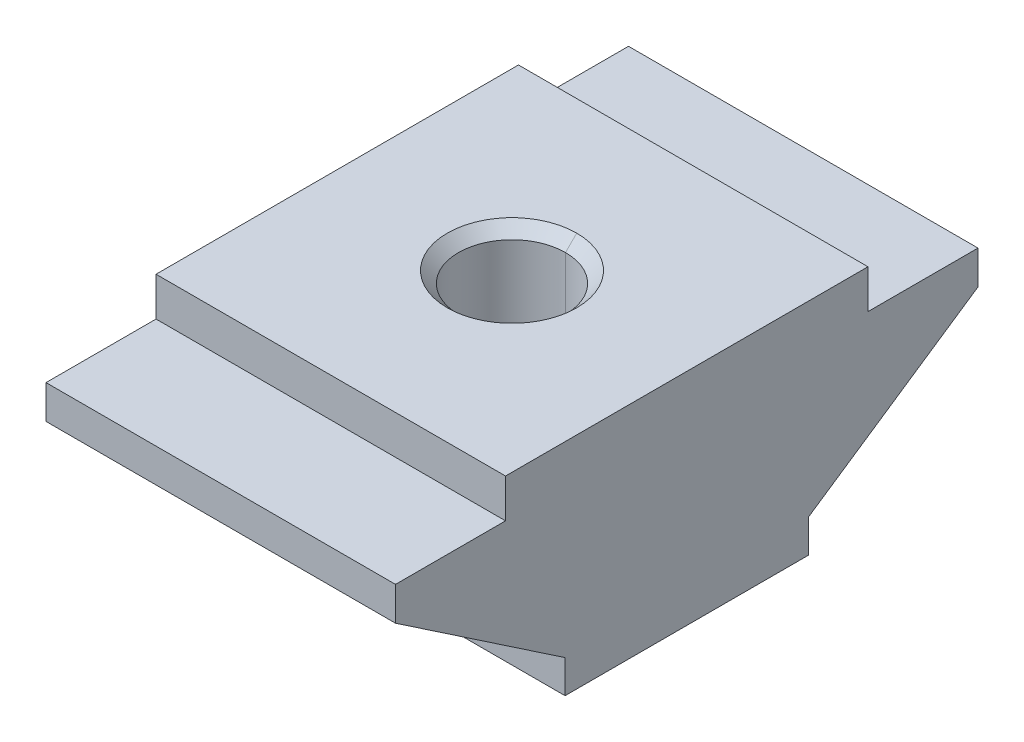
ISO-10303-21;
HEADER;
FILE_DESCRIPTION(('STEP AP214'),'2;1');
FILE_NAME('part.step','',(''),(''),'','','');
FILE_SCHEMA(('AUTOMOTIVE_DESIGN { 1 0 10303 214 1 1 1 1 }'));
ENDSEC;
DATA;
#1=APPLICATION_CONTEXT('core data for automotive mechanical design processes');
#2=APPLICATION_PROTOCOL_DEFINITION('international standard','automotive_design',2000,#1);
#3=PRODUCT_CONTEXT('',#1,'mechanical');
#4=PRODUCT('Part','Part','',(#3));
#5=PRODUCT_RELATED_PRODUCT_CATEGORY('part','',(#4));
#6=PRODUCT_DEFINITION_FORMATION('','',#4);
#7=PRODUCT_DEFINITION_CONTEXT('part definition',#1,'design');
#8=PRODUCT_DEFINITION('design','',#6,#7);
#9=PRODUCT_DEFINITION_SHAPE('','',#8);
#10=(LENGTH_UNIT() NAMED_UNIT(*) SI_UNIT(.MILLI.,.METRE.));
#11=(NAMED_UNIT(*) PLANE_ANGLE_UNIT() SI_UNIT($,.RADIAN.));
#12=(NAMED_UNIT(*) SI_UNIT($,.STERADIAN.) SOLID_ANGLE_UNIT());
#13=UNCERTAINTY_MEASURE_WITH_UNIT(LENGTH_MEASURE(1.E-05),#10,'distance_accuracy_value','');
#14=(GEOMETRIC_REPRESENTATION_CONTEXT(3) GLOBAL_UNCERTAINTY_ASSIGNED_CONTEXT((#13)) GLOBAL_UNIT_ASSIGNED_CONTEXT((#10,
#11,#12)) REPRESENTATION_CONTEXT('',''));
#15=CARTESIAN_POINT('',(0.,0.,0.));
#16=DIRECTION('',(0.,0.,1.));
#17=DIRECTION('',(1.,0.,0.));
#18=AXIS2_PLACEMENT_3D('',#15,#16,#17);
#19=CARTESIAN_POINT('',(6.75,7.,7.));
#20=DIRECTION('',(0.,-1.,0.));
#21=DIRECTION('',(0.,0.,-1.));
#22=AXIS2_PLACEMENT_3D('',#19,#20,#21);
#23=PLANE('',#22);
#24=DIRECTION('',(0.,0.,1.));
#25=VECTOR('',#24,1.);
#26=CARTESIAN_POINT('',(-6.75,7.,7.));
#27=LINE('',#26,#25);
#28=CARTESIAN_POINT('',(-6.75,7.,7.));
#29=VERTEX_POINT('',#28);
#30=CARTESIAN_POINT('',(-6.75,7.,11.25));
#31=VERTEX_POINT('',#30);
#32=EDGE_CURVE('E13',#29,#31,#27,.T.);
#33=ORIENTED_EDGE('',*,*,#32,.T.);
#34=DIRECTION('',(-1.,0.,0.));
#35=VECTOR('',#34,1.);
#36=CARTESIAN_POINT('',(6.75,7.,11.25));
#37=LINE('',#36,#35);
#38=CARTESIAN_POINT('',(6.75,7.,11.25));
#39=VERTEX_POINT('',#38);
#40=EDGE_CURVE('E33',#39,#31,#37,.T.);
#41=ORIENTED_EDGE('',*,*,#40,.F.);
#42=DIRECTION('',(0.,0.,1.));
#43=VECTOR('',#42,1.);
#44=CARTESIAN_POINT('',(6.75,7.,7.));
#45=LINE('',#44,#43);
#46=CARTESIAN_POINT('',(6.75,7.,7.));
#47=VERTEX_POINT('',#46);
#48=EDGE_CURVE('E365',#47,#39,#45,.T.);
#49=ORIENTED_EDGE('',*,*,#48,.F.);
#50=DIRECTION('',(-1.,0.,0.));
#51=VECTOR('',#50,1.);
#52=CARTESIAN_POINT('',(6.75,7.,7.));
#53=LINE('',#52,#51);
#54=EDGE_CURVE('E361',#47,#29,#53,.T.);
#55=ORIENTED_EDGE('',*,*,#54,.T.);
#56=EDGE_LOOP('',(#33,#41,#49,#55));
#57=FACE_BOUND('',#56,.T.);
#58=ADVANCED_FACE('F25',(#57),#23,.F.);
#59=CARTESIAN_POINT('',(6.75,8.5,7.));
#60=DIRECTION('',(0.,0.,-1.));
#61=DIRECTION('',(-1.,0.,0.));
#62=AXIS2_PLACEMENT_3D('',#59,#60,#61);
#63=PLANE('',#62);
#64=DIRECTION('',(0.,-1.,0.));
#65=VECTOR('',#64,1.);
#66=CARTESIAN_POINT('',(-6.75,8.5,7.));
#67=LINE('',#66,#65);
#68=CARTESIAN_POINT('',(-6.75,8.5,7.));
#69=VERTEX_POINT('',#68);
#70=EDGE_CURVE('E356',#69,#29,#67,.T.);
#71=ORIENTED_EDGE('',*,*,#70,.T.);
#72=ORIENTED_EDGE('',*,*,#54,.F.);
#73=DIRECTION('',(0.,-1.,0.));
#74=VECTOR('',#73,1.);
#75=CARTESIAN_POINT('',(6.75,8.5,7.));
#76=LINE('',#75,#74);
#77=CARTESIAN_POINT('',(6.75,8.5,7.));
#78=VERTEX_POINT('',#77);
#79=EDGE_CURVE('E351',#78,#47,#76,.T.);
#80=ORIENTED_EDGE('',*,*,#79,.F.);
#81=DIRECTION('',(-1.,0.,0.));
#82=VECTOR('',#81,1.);
#83=CARTESIAN_POINT('',(6.75,8.5,7.));
#84=LINE('',#83,#82);
#85=EDGE_CURVE('E347',#78,#69,#84,.T.);
#86=ORIENTED_EDGE('',*,*,#85,.T.);
#87=EDGE_LOOP('',(#71,#72,#80,#86));
#88=FACE_BOUND('',#87,.T.);
#89=ADVANCED_FACE('F391',(#88),#63,.F.);
#90=CARTESIAN_POINT('',(6.75,8.5,-7.));
#91=DIRECTION('',(0.,-1.,0.));
#92=DIRECTION('',(0.,0.,-1.));
#93=AXIS2_PLACEMENT_3D('',#90,#91,#92);
#94=PLANE('',#93);
#95=CARTESIAN_POINT('',(0.,8.5,0.));
#96=DIRECTION('',(0.,-1.,0.));
#97=DIRECTION('',(0.,0.,-1.));
#98=AXIS2_PLACEMENT_3D('',#95,#96,#97);
#99=CIRCLE('',#98,2.5);
#100=CARTESIAN_POINT('',(0.,8.5,-2.5));
#101=VERTEX_POINT('',#100);
#102=CARTESIAN_POINT('',(0.,8.5,2.5));
#103=VERTEX_POINT('',#102);
#104=EDGE_CURVE('E162',#101,#103,#99,.T.);
#105=ORIENTED_EDGE('',*,*,#104,.T.);
#106=CARTESIAN_POINT('',(0.,8.5,0.));
#107=DIRECTION('',(0.,-1.,0.));
#108=DIRECTION('',(0.,0.,-1.));
#109=AXIS2_PLACEMENT_3D('',#106,#107,#108);
#110=CIRCLE('',#109,2.5);
#111=EDGE_CURVE('E340',#103,#101,#110,.T.);
#112=ORIENTED_EDGE('',*,*,#111,.T.);
#113=EDGE_LOOP('',(#105,#112));
#114=FACE_BOUND('',#113,.T.);
#115=DIRECTION('',(0.,0.,1.));
#116=VECTOR('',#115,1.);
#117=CARTESIAN_POINT('',(-6.75,8.5,-7.));
#118=LINE('',#117,#116);
#119=CARTESIAN_POINT('',(-6.75,8.5,-7.));
#120=VERTEX_POINT('',#119);
#121=EDGE_CURVE('E335',#120,#69,#118,.T.);
#122=ORIENTED_EDGE('',*,*,#121,.T.);
#123=ORIENTED_EDGE('',*,*,#85,.F.);
#124=DIRECTION('',(0.,0.,1.));
#125=VECTOR('',#124,1.);
#126=CARTESIAN_POINT('',(6.75,8.5,-7.));
#127=LINE('',#126,#125);
#128=CARTESIAN_POINT('',(6.75,8.5,-7.));
#129=VERTEX_POINT('',#128);
#130=EDGE_CURVE('E330',#129,#78,#127,.T.);
#131=ORIENTED_EDGE('',*,*,#130,.F.);
#132=DIRECTION('',(-1.,0.,0.));
#133=VECTOR('',#132,1.);
#134=CARTESIAN_POINT('',(6.75,8.5,-7.));
#135=LINE('',#134,#133);
#136=EDGE_CURVE('E326',#129,#120,#135,.T.);
#137=ORIENTED_EDGE('',*,*,#136,.T.);
#138=EDGE_LOOP('',(#122,#123,#131,#137));
#139=FACE_BOUND('',#138,.T.);
#140=ADVANCED_FACE('F397',(#114,#139),#94,.F.);
#141=CARTESIAN_POINT('',(6.75,7.,-7.));
#142=DIRECTION('',(0.,0.,1.));
#143=DIRECTION('',(1.,0.,0.));
#144=AXIS2_PLACEMENT_3D('',#141,#142,#143);
#145=PLANE('',#144);
#146=DIRECTION('',(0.,1.,0.));
#147=VECTOR('',#146,1.);
#148=CARTESIAN_POINT('',(-6.75,7.,-7.));
#149=LINE('',#148,#147);
#150=CARTESIAN_POINT('',(-6.75,7.,-7.));
#151=VERTEX_POINT('',#150);
#152=EDGE_CURVE('E321',#151,#120,#149,.T.);
#153=ORIENTED_EDGE('',*,*,#152,.T.);
#154=ORIENTED_EDGE('',*,*,#136,.F.);
#155=DIRECTION('',(0.,1.,0.));
#156=VECTOR('',#155,1.);
#157=CARTESIAN_POINT('',(6.75,7.,-7.));
#158=LINE('',#157,#156);
#159=CARTESIAN_POINT('',(6.75,7.,-7.));
#160=VERTEX_POINT('',#159);
#161=EDGE_CURVE('E316',#160,#129,#158,.T.);
#162=ORIENTED_EDGE('',*,*,#161,.F.);
#163=DIRECTION('',(-1.,0.,0.));
#164=VECTOR('',#163,1.);
#165=CARTESIAN_POINT('',(6.75,7.,-7.));
#166=LINE('',#165,#164);
#167=EDGE_CURVE('E312',#160,#151,#166,.T.);
#168=ORIENTED_EDGE('',*,*,#167,.T.);
#169=EDGE_LOOP('',(#153,#154,#162,#168));
#170=FACE_BOUND('',#169,.T.);
#171=ADVANCED_FACE('F400',(#170),#145,.F.);
#172=CARTESIAN_POINT('',(6.75,7.,-11.25));
#173=DIRECTION('',(0.,-1.,0.));
#174=DIRECTION('',(0.,0.,-1.));
#175=AXIS2_PLACEMENT_3D('',#172,#173,#174);
#176=PLANE('',#175);
#177=DIRECTION('',(0.,0.,1.));
#178=VECTOR('',#177,1.);
#179=CARTESIAN_POINT('',(-6.75,7.,-11.25));
#180=LINE('',#179,#178);
#181=CARTESIAN_POINT('',(-6.75,7.,-11.25));
#182=VERTEX_POINT('',#181);
#183=EDGE_CURVE('E307',#182,#151,#180,.T.);
#184=ORIENTED_EDGE('',*,*,#183,.T.);
#185=ORIENTED_EDGE('',*,*,#167,.F.);
#186=DIRECTION('',(0.,0.,1.));
#187=VECTOR('',#186,1.);
#188=CARTESIAN_POINT('',(6.75,7.,-11.25));
#189=LINE('',#188,#187);
#190=CARTESIAN_POINT('',(6.75,7.,-11.25));
#191=VERTEX_POINT('',#190);
#192=EDGE_CURVE('E302',#191,#160,#189,.T.);
#193=ORIENTED_EDGE('',*,*,#192,.F.);
#194=DIRECTION('',(-1.,0.,0.));
#195=VECTOR('',#194,1.);
#196=CARTESIAN_POINT('',(6.75,7.,-11.25));
#197=LINE('',#196,#195);
#198=EDGE_CURVE('E298',#191,#182,#197,.T.);
#199=ORIENTED_EDGE('',*,*,#198,.T.);
#200=EDGE_LOOP('',(#184,#185,#193,#199));
#201=FACE_BOUND('',#200,.T.);
#202=ADVANCED_FACE('F403',(#201),#176,.F.);
#203=CARTESIAN_POINT('',(6.75,5.7,-11.25));
#204=DIRECTION('',(0.,0.,1.));
#205=DIRECTION('',(1.,0.,0.));
#206=AXIS2_PLACEMENT_3D('',#203,#204,#205);
#207=PLANE('',#206);
#208=DIRECTION('',(0.,1.,0.));
#209=VECTOR('',#208,1.);
#210=CARTESIAN_POINT('',(-6.75,5.7,-11.25));
#211=LINE('',#210,#209);
#212=CARTESIAN_POINT('',(-6.75,5.7,-11.25));
#213=VERTEX_POINT('',#212);
#214=EDGE_CURVE('E293',#213,#182,#211,.T.);
#215=ORIENTED_EDGE('',*,*,#214,.T.);
#216=ORIENTED_EDGE('',*,*,#198,.F.);
#217=DIRECTION('',(0.,1.,0.));
#218=VECTOR('',#217,1.);
#219=CARTESIAN_POINT('',(6.75,5.7,-11.25));
#220=LINE('',#219,#218);
#221=CARTESIAN_POINT('',(6.75,5.7,-11.25));
#222=VERTEX_POINT('',#221);
#223=EDGE_CURVE('E288',#222,#191,#220,.T.);
#224=ORIENTED_EDGE('',*,*,#223,.F.);
#225=DIRECTION('',(-1.,0.,0.));
#226=VECTOR('',#225,1.);
#227=CARTESIAN_POINT('',(6.75,5.7,-11.25));
#228=LINE('',#227,#226);
#229=EDGE_CURVE('E284',#222,#213,#228,.T.);
#230=ORIENTED_EDGE('',*,*,#229,.T.);
#231=EDGE_LOOP('',(#215,#216,#224,#230));
#232=FACE_BOUND('',#231,.T.);
#233=ADVANCED_FACE('F409',(#232),#207,.F.);
#234=CARTESIAN_POINT('',(6.75,1.275,-4.7));
#235=DIRECTION('',(0.,0.828628619379629,0.559798723779368));
#236=DIRECTION('',(0.,-0.559798723779368,0.828628619379629));
#237=AXIS2_PLACEMENT_3D('',#234,#235,#236);
#238=PLANE('',#237);
#239=DIRECTION('',(0.,0.559798723779368,-0.828628619379629));
#240=VECTOR('',#239,1.);
#241=CARTESIAN_POINT('',(-6.75,1.275,-4.7));
#242=LINE('',#241,#240);
#243=CARTESIAN_POINT('',(-6.75,1.275,-4.7));
#244=VERTEX_POINT('',#243);
#245=EDGE_CURVE('E279',#244,#213,#242,.T.);
#246=ORIENTED_EDGE('',*,*,#245,.T.);
#247=ORIENTED_EDGE('',*,*,#229,.F.);
#248=DIRECTION('',(0.,0.559798723779368,-0.828628619379629));
#249=VECTOR('',#248,1.);
#250=CARTESIAN_POINT('',(6.75,1.275,-4.7));
#251=LINE('',#250,#249);
#252=CARTESIAN_POINT('',(6.75,1.275,-4.7));
#253=VERTEX_POINT('',#252);
#254=EDGE_CURVE('E274',#253,#222,#251,.T.);
#255=ORIENTED_EDGE('',*,*,#254,.F.);
#256=DIRECTION('',(-1.,0.,0.));
#257=VECTOR('',#256,1.);
#258=CARTESIAN_POINT('',(6.75,1.275,-4.7));
#259=LINE('',#258,#257);
#260=EDGE_CURVE('E270',#253,#244,#259,.T.);
#261=ORIENTED_EDGE('',*,*,#260,.T.);
#262=EDGE_LOOP('',(#246,#247,#255,#261));
#263=FACE_BOUND('',#262,.T.);
#264=ADVANCED_FACE('F412',(#263),#238,.F.);
#265=CARTESIAN_POINT('',(6.75,0.,-4.7));
#266=DIRECTION('',(0.,0.,1.));
#267=DIRECTION('',(1.,0.,0.));
#268=AXIS2_PLACEMENT_3D('',#265,#266,#267);
#269=PLANE('',#268);
#270=DIRECTION('',(0.,1.,0.));
#271=VECTOR('',#270,1.);
#272=CARTESIAN_POINT('',(-6.75,0.,-4.7));
#273=LINE('',#272,#271);
#274=CARTESIAN_POINT('',(-6.75,0.,-4.7));
#275=VERTEX_POINT('',#274);
#276=EDGE_CURVE('E265',#275,#244,#273,.T.);
#277=ORIENTED_EDGE('',*,*,#276,.T.);
#278=ORIENTED_EDGE('',*,*,#260,.F.);
#279=DIRECTION('',(0.,1.,0.));
#280=VECTOR('',#279,1.);
#281=CARTESIAN_POINT('',(6.75,0.,-4.7));
#282=LINE('',#281,#280);
#283=CARTESIAN_POINT('',(6.75,0.,-4.7));
#284=VERTEX_POINT('',#283);
#285=EDGE_CURVE('E260',#284,#253,#282,.T.);
#286=ORIENTED_EDGE('',*,*,#285,.F.);
#287=DIRECTION('',(-1.,0.,0.));
#288=VECTOR('',#287,1.);
#289=CARTESIAN_POINT('',(6.75,0.,-4.7));
#290=LINE('',#289,#288);
#291=EDGE_CURVE('E256',#284,#275,#290,.T.);
#292=ORIENTED_EDGE('',*,*,#291,.T.);
#293=EDGE_LOOP('',(#277,#278,#286,#292));
#294=FACE_BOUND('',#293,.T.);
#295=ADVANCED_FACE('F415',(#294),#269,.F.);
#296=CARTESIAN_POINT('',(6.75,0.,4.7));
#297=DIRECTION('',(0.,1.,0.));
#298=DIRECTION('',(0.,0.,1.));
#299=AXIS2_PLACEMENT_3D('',#296,#297,#298);
#300=PLANE('',#299);
#301=CARTESIAN_POINT('',(0.,0.,0.));
#302=DIRECTION('',(0.,-1.,0.));
#303=DIRECTION('',(0.,0.,-1.));
#304=AXIS2_PLACEMENT_3D('',#301,#302,#303);
#305=CIRCLE('',#304,2.5);
#306=CARTESIAN_POINT('',(0.,0.,-2.5));
#307=VERTEX_POINT('',#306);
#308=CARTESIAN_POINT('',(0.,1.10494946525819E-12,2.5000000000011));
#309=VERTEX_POINT('',#308);
#310=EDGE_CURVE('E251',#307,#309,#305,.T.);
#311=ORIENTED_EDGE('',*,*,#310,.F.);
#312=CARTESIAN_POINT('',(0.,0.,0.));
#313=DIRECTION('',(0.,-1.,0.));
#314=DIRECTION('',(0.,0.,-1.));
#315=AXIS2_PLACEMENT_3D('',#312,#313,#314);
#316=CIRCLE('',#315,2.5);
#317=EDGE_CURVE('E246',#309,#307,#316,.T.);
#318=ORIENTED_EDGE('',*,*,#317,.F.);
#319=EDGE_LOOP('',(#311,#318));
#320=FACE_BOUND('',#319,.T.);
#321=DIRECTION('',(0.,0.,-1.));
#322=VECTOR('',#321,1.);
#323=CARTESIAN_POINT('',(-6.75,0.,4.7));
#324=LINE('',#323,#322);
#325=CARTESIAN_POINT('',(-6.75,0.,4.7));
#326=VERTEX_POINT('',#325);
#327=EDGE_CURVE('E241',#326,#275,#324,.T.);
#328=ORIENTED_EDGE('',*,*,#327,.T.);
#329=ORIENTED_EDGE('',*,*,#291,.F.);
#330=DIRECTION('',(0.,0.,-1.));
#331=VECTOR('',#330,1.);
#332=CARTESIAN_POINT('',(6.75,0.,4.7));
#333=LINE('',#332,#331);
#334=CARTESIAN_POINT('',(6.75,0.,4.7));
#335=VERTEX_POINT('',#334);
#336=EDGE_CURVE('E236',#335,#284,#333,.T.);
#337=ORIENTED_EDGE('',*,*,#336,.F.);
#338=DIRECTION('',(-1.,0.,0.));
#339=VECTOR('',#338,1.);
#340=CARTESIAN_POINT('',(6.75,0.,4.7));
#341=LINE('',#340,#339);
#342=EDGE_CURVE('E232',#335,#326,#341,.T.);
#343=ORIENTED_EDGE('',*,*,#342,.T.);
#344=EDGE_LOOP('',(#328,#329,#337,#343));
#345=FACE_BOUND('',#344,.T.);
#346=ADVANCED_FACE('F418',(#320,#345),#300,.F.);
#347=CARTESIAN_POINT('',(6.75,1.275,4.7));
#348=DIRECTION('',(0.,0.,-1.));
#349=DIRECTION('',(-1.,0.,0.));
#350=AXIS2_PLACEMENT_3D('',#347,#348,#349);
#351=PLANE('',#350);
#352=DIRECTION('',(0.,-1.,0.));
#353=VECTOR('',#352,1.);
#354=CARTESIAN_POINT('',(-6.75,1.275,4.7));
#355=LINE('',#354,#353);
#356=CARTESIAN_POINT('',(-6.75,1.275,4.7));
#357=VERTEX_POINT('',#356);
#358=EDGE_CURVE('E227',#357,#326,#355,.T.);
#359=ORIENTED_EDGE('',*,*,#358,.T.);
#360=ORIENTED_EDGE('',*,*,#342,.F.);
#361=DIRECTION('',(0.,-1.,0.));
#362=VECTOR('',#361,1.);
#363=CARTESIAN_POINT('',(6.75,1.275,4.7));
#364=LINE('',#363,#362);
#365=CARTESIAN_POINT('',(6.75,1.275,4.7));
#366=VERTEX_POINT('',#365);
#367=EDGE_CURVE('E222',#366,#335,#364,.T.);
#368=ORIENTED_EDGE('',*,*,#367,.F.);
#369=DIRECTION('',(-1.,0.,0.));
#370=VECTOR('',#369,1.);
#371=CARTESIAN_POINT('',(6.75,1.275,4.7));
#372=LINE('',#371,#370);
#373=EDGE_CURVE('E218',#366,#357,#372,.T.);
#374=ORIENTED_EDGE('',*,*,#373,.T.);
#375=EDGE_LOOP('',(#359,#360,#368,#374));
#376=FACE_BOUND('',#375,.T.);
#377=ADVANCED_FACE('F421',(#376),#351,.F.);
#378=CARTESIAN_POINT('',(6.75,5.7,11.25));
#379=DIRECTION('',(0.,0.828628619379629,-0.559798723779368));
#380=DIRECTION('',(0.,0.559798723779368,0.828628619379629));
#381=AXIS2_PLACEMENT_3D('',#378,#379,#380);
#382=PLANE('',#381);
#383=DIRECTION('',(0.,-0.559798723779368,-0.828628619379629));
#384=VECTOR('',#383,1.);
#385=CARTESIAN_POINT('',(-6.75,5.7,11.25));
#386=LINE('',#385,#384);
#387=CARTESIAN_POINT('',(-6.75,5.7,11.25));
#388=VERTEX_POINT('',#387);
#389=EDGE_CURVE('E213',#388,#357,#386,.T.);
#390=ORIENTED_EDGE('',*,*,#389,.T.);
#391=ORIENTED_EDGE('',*,*,#373,.F.);
#392=DIRECTION('',(0.,-0.559798723779368,-0.828628619379629));
#393=VECTOR('',#392,1.);
#394=CARTESIAN_POINT('',(6.75,5.7,11.25));
#395=LINE('',#394,#393);
#396=CARTESIAN_POINT('',(6.75,5.7,11.25));
#397=VERTEX_POINT('',#396);
#398=EDGE_CURVE('E208',#397,#366,#395,.T.);
#399=ORIENTED_EDGE('',*,*,#398,.F.);
#400=DIRECTION('',(-1.,0.,0.));
#401=VECTOR('',#400,1.);
#402=CARTESIAN_POINT('',(6.75,5.7,11.25));
#403=LINE('',#402,#401);
#404=EDGE_CURVE('E204',#397,#388,#403,.T.);
#405=ORIENTED_EDGE('',*,*,#404,.T.);
#406=EDGE_LOOP('',(#390,#391,#399,#405));
#407=FACE_BOUND('',#406,.T.);
#408=ADVANCED_FACE('F386',(#407),#382,.F.);
#409=CARTESIAN_POINT('',(6.75,7.,11.25));
#410=DIRECTION('',(0.,0.,-1.));
#411=DIRECTION('',(-1.,0.,0.));
#412=AXIS2_PLACEMENT_3D('',#409,#410,#411);
#413=PLANE('',#412);
#414=DIRECTION('',(0.,-1.,0.));
#415=VECTOR('',#414,1.);
#416=CARTESIAN_POINT('',(-6.75,7.,11.25));
#417=LINE('',#416,#415);
#418=EDGE_CURVE('E199',#31,#388,#417,.T.);
#419=ORIENTED_EDGE('',*,*,#418,.T.);
#420=ORIENTED_EDGE('',*,*,#404,.F.);
#421=DIRECTION('',(0.,-1.,0.));
#422=VECTOR('',#421,1.);
#423=CARTESIAN_POINT('',(6.75,7.,11.25));
#424=LINE('',#423,#422);
#425=EDGE_CURVE('E194',#39,#397,#424,.T.);
#426=ORIENTED_EDGE('',*,*,#425,.F.);
#427=ORIENTED_EDGE('',*,*,#40,.T.);
#428=EDGE_LOOP('',(#419,#420,#426,#427));
#429=FACE_BOUND('',#428,.T.);
#430=ADVANCED_FACE('F376',(#429),#413,.F.);
#431=CARTESIAN_POINT('',(6.75,0.,0.));
#432=DIRECTION('',(1.,0.,0.));
#433=DIRECTION('',(0.,0.,-1.));
#434=AXIS2_PLACEMENT_3D('',#431,#432,#433);
#435=PLANE('',#434);
#436=ORIENTED_EDGE('',*,*,#425,.T.);
#437=ORIENTED_EDGE('',*,*,#398,.T.);
#438=ORIENTED_EDGE('',*,*,#367,.T.);
#439=ORIENTED_EDGE('',*,*,#336,.T.);
#440=ORIENTED_EDGE('',*,*,#285,.T.);
#441=ORIENTED_EDGE('',*,*,#254,.T.);
#442=ORIENTED_EDGE('',*,*,#223,.T.);
#443=ORIENTED_EDGE('',*,*,#192,.T.);
#444=ORIENTED_EDGE('',*,*,#161,.T.);
#445=ORIENTED_EDGE('',*,*,#130,.T.);
#446=ORIENTED_EDGE('',*,*,#79,.T.);
#447=ORIENTED_EDGE('',*,*,#48,.T.);
#448=EDGE_LOOP('',(#436,#437,#438,#439,#440,#441,#442,#443,#444,#445,#446,#447));
#449=FACE_BOUND('',#448,.T.);
#450=ADVANCED_FACE('F388',(#449),#435,.T.);
#451=CARTESIAN_POINT('',(-6.75,0.,0.));
#452=DIRECTION('',(1.,0.,0.));
#453=DIRECTION('',(0.,0.,-1.));
#454=AXIS2_PLACEMENT_3D('',#451,#452,#453);
#455=PLANE('',#454);
#456=ORIENTED_EDGE('',*,*,#418,.F.);
#457=ORIENTED_EDGE('',*,*,#32,.F.);
#458=ORIENTED_EDGE('',*,*,#70,.F.);
#459=ORIENTED_EDGE('',*,*,#121,.F.);
#460=ORIENTED_EDGE('',*,*,#152,.F.);
#461=ORIENTED_EDGE('',*,*,#183,.F.);
#462=ORIENTED_EDGE('',*,*,#214,.F.);
#463=ORIENTED_EDGE('',*,*,#245,.F.);
#464=ORIENTED_EDGE('',*,*,#276,.F.);
#465=ORIENTED_EDGE('',*,*,#327,.F.);
#466=ORIENTED_EDGE('',*,*,#358,.F.);
#467=ORIENTED_EDGE('',*,*,#389,.F.);
#468=EDGE_LOOP('',(#456,#457,#458,#459,#460,#461,#462,#463,#464,#465,#466,#467));
#469=FACE_BOUND('',#468,.T.);
#470=ADVANCED_FACE('F380',(#469),#455,.F.);
#471=CARTESIAN_POINT('',(0.,0.433,0.));
#472=DIRECTION('',(0.,-1.,0.));
#473=DIRECTION('',(1.,0.,0.));
#474=AXIS2_PLACEMENT_3D('',#471,#472,#473);
#475=CONICAL_SURFACE('',#474,2.067,0.7853981634);
#476=CARTESIAN_POINT('',(0.,0.433,0.));
#477=DIRECTION('',(0.,-1.,0.));
#478=DIRECTION('',(0.,0.,-1.));
#479=AXIS2_PLACEMENT_3D('',#476,#477,#478);
#480=CIRCLE('',#479,2.067);
#481=CARTESIAN_POINT('',(0.,0.433,2.067));
#482=VERTEX_POINT('',#481);
#483=CARTESIAN_POINT('',(0.,0.433,-2.067));
#484=VERTEX_POINT('',#483);
#485=EDGE_CURVE('E151',#482,#484,#480,.T.);
#486=ORIENTED_EDGE('',*,*,#485,.F.);
#487=DIRECTION('',(0.,-0.707106781184743,0.707106781188352));
#488=VECTOR('',#487,1.);
#489=CARTESIAN_POINT('',(0.,0.433,2.067));
#490=LINE('',#489,#488);
#491=EDGE_CURVE('E186',#482,#309,#490,.T.);
#492=ORIENTED_EDGE('',*,*,#491,.T.);
#493=ORIENTED_EDGE('',*,*,#317,.T.);
#494=DIRECTION('',(0.,-0.707106781184743,-0.707106781188352));
#495=VECTOR('',#494,1.);
#496=CARTESIAN_POINT('',(0.,0.433,-2.067));
#497=LINE('',#496,#495);
#498=EDGE_CURVE('E181',#484,#307,#497,.T.);
#499=ORIENTED_EDGE('',*,*,#498,.F.);
#500=EDGE_LOOP('',(#486,#492,#493,#499));
#501=FACE_BOUND('',#500,.T.);
#502=ADVANCED_FACE('F498',(#501),#475,.F.);
#503=CARTESIAN_POINT('',(0.,0.433,0.));
#504=DIRECTION('',(0.,-1.,0.));
#505=DIRECTION('',(-1.,0.,0.));
#506=AXIS2_PLACEMENT_3D('',#503,#504,#505);
#507=CONICAL_SURFACE('',#506,2.067,0.7853981634);
#508=ORIENTED_EDGE('',*,*,#310,.T.);
#509=ORIENTED_EDGE('',*,*,#491,.F.);
#510=CARTESIAN_POINT('',(0.,0.433,0.));
#511=DIRECTION('',(0.,-1.,0.));
#512=DIRECTION('',(0.,0.,-1.));
#513=AXIS2_PLACEMENT_3D('',#510,#511,#512);
#514=CIRCLE('',#513,2.067);
#515=EDGE_CURVE('E177',#484,#482,#514,.T.);
#516=ORIENTED_EDGE('',*,*,#515,.F.);
#517=ORIENTED_EDGE('',*,*,#498,.T.);
#518=EDGE_LOOP('',(#508,#509,#516,#517));
#519=FACE_BOUND('',#518,.T.);
#520=ADVANCED_FACE('F507',(#519),#507,.F.);
#521=CARTESIAN_POINT('',(0.,0.,0.));
#522=DIRECTION('',(0.,1.,0.));
#523=DIRECTION('',(-1.,0.,0.));
#524=AXIS2_PLACEMENT_3D('',#521,#522,#523);
#525=CYLINDRICAL_SURFACE('',#524,2.067);
#526=ORIENTED_EDGE('',*,*,#515,.T.);
#527=DIRECTION('',(0.,1.,0.));
#528=VECTOR('',#527,1.);
#529=CARTESIAN_POINT('',(0.,0.433,2.067));
#530=LINE('',#529,#528);
#531=CARTESIAN_POINT('',(0.,8.067,2.067));
#532=VERTEX_POINT('',#531);
#533=EDGE_CURVE('E140',#482,#532,#530,.T.);
#534=ORIENTED_EDGE('',*,*,#533,.T.);
#535=CARTESIAN_POINT('',(0.,8.067,0.));
#536=DIRECTION('',(0.,-1.,0.));
#537=DIRECTION('',(0.,0.,-1.));
#538=AXIS2_PLACEMENT_3D('',#535,#536,#537);
#539=CIRCLE('',#538,2.067);
#540=CARTESIAN_POINT('',(0.,8.067,-2.067));
#541=VERTEX_POINT('',#540);
#542=EDGE_CURVE('E133',#541,#532,#539,.T.);
#543=ORIENTED_EDGE('',*,*,#542,.F.);
#544=DIRECTION('',(0.,1.,0.));
#545=VECTOR('',#544,1.);
#546=CARTESIAN_POINT('',(0.,0.433,-2.067));
#547=LINE('',#546,#545);
#548=EDGE_CURVE('E137',#484,#541,#547,.T.);
#549=ORIENTED_EDGE('',*,*,#548,.F.);
#550=EDGE_LOOP('',(#526,#534,#543,#549));
#551=FACE_BOUND('',#550,.T.);
#552=ADVANCED_FACE('F136',(#551),#525,.F.);
#553=CARTESIAN_POINT('',(0.,0.,0.));
#554=DIRECTION('',(0.,1.,0.));
#555=DIRECTION('',(1.,0.,0.));
#556=AXIS2_PLACEMENT_3D('',#553,#554,#555);
#557=CYLINDRICAL_SURFACE('',#556,2.067);
#558=CARTESIAN_POINT('',(0.,8.067,0.));
#559=DIRECTION('',(0.,-1.,0.));
#560=DIRECTION('',(0.,0.,-1.));
#561=AXIS2_PLACEMENT_3D('',#558,#559,#560);
#562=CIRCLE('',#561,2.067);
#563=EDGE_CURVE('E149',#532,#541,#562,.T.);
#564=ORIENTED_EDGE('',*,*,#563,.F.);
#565=ORIENTED_EDGE('',*,*,#533,.F.);
#566=ORIENTED_EDGE('',*,*,#485,.T.);
#567=ORIENTED_EDGE('',*,*,#548,.T.);
#568=EDGE_LOOP('',(#564,#565,#566,#567));
#569=FACE_BOUND('',#568,.T.);
#570=ADVANCED_FACE('F148',(#569),#557,.F.);
#571=CARTESIAN_POINT('',(0.,8.5,0.));
#572=DIRECTION('',(0.,1.,0.));
#573=DIRECTION('',(1.,0.,0.));
#574=AXIS2_PLACEMENT_3D('',#571,#572,#573);
#575=CONICAL_SURFACE('',#574,2.5,0.7853981634);
#576=ORIENTED_EDGE('',*,*,#111,.F.);
#577=DIRECTION('',(0.,0.707106781184743,0.707106781188352));
#578=VECTOR('',#577,1.);
#579=CARTESIAN_POINT('',(0.,8.06700000000111,2.0669999999989));
#580=LINE('',#579,#578);
#581=EDGE_CURVE('E159',#532,#103,#580,.T.);
#582=ORIENTED_EDGE('',*,*,#581,.F.);
#583=ORIENTED_EDGE('',*,*,#563,.T.);
#584=DIRECTION('',(0.,0.707106781184743,-0.707106781188352));
#585=VECTOR('',#584,1.);
#586=CARTESIAN_POINT('',(0.,8.06700000000111,-2.0669999999989));
#587=LINE('',#586,#585);
#588=EDGE_CURVE('E157',#541,#101,#587,.T.);
#589=ORIENTED_EDGE('',*,*,#588,.T.);
#590=EDGE_LOOP('',(#576,#582,#583,#589));
#591=FACE_BOUND('',#590,.T.);
#592=ADVANCED_FACE('F156',(#591),#575,.F.);
#593=CARTESIAN_POINT('',(0.,8.5,0.));
#594=DIRECTION('',(0.,1.,0.));
#595=DIRECTION('',(-1.,0.,0.));
#596=AXIS2_PLACEMENT_3D('',#593,#594,#595);
#597=CONICAL_SURFACE('',#596,2.5,0.7853981634);
#598=ORIENTED_EDGE('',*,*,#542,.T.);
#599=ORIENTED_EDGE('',*,*,#581,.T.);
#600=ORIENTED_EDGE('',*,*,#104,.F.);
#601=ORIENTED_EDGE('',*,*,#588,.F.);
#602=EDGE_LOOP('',(#598,#599,#600,#601));
#603=FACE_BOUND('',#602,.T.);
#604=ADVANCED_FACE('F161',(#603),#597,.F.);
#605=CLOSED_SHELL('',(#58,#89,#140,#171,#202,#233,#264,#295,#346,#377,#408,#430,#450,#470,#502,
#520,#552,#570,#592,#604));
#606=MANIFOLD_SOLID_BREP('B1',#605);
#607=ADVANCED_BREP_SHAPE_REPRESENTATION('',(#18,#606),#14);
#608=SHAPE_DEFINITION_REPRESENTATION(#9,#607);
ENDSEC;
END-ISO-10303-21;
